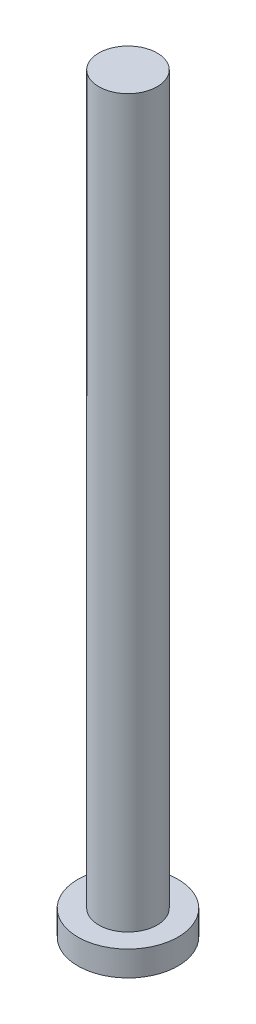
ISO-10303-21;
HEADER;
FILE_DESCRIPTION(('STEP AP214'),'2;1');
FILE_NAME('part.step','',(''),(''),'','','');
FILE_SCHEMA(('AUTOMOTIVE_DESIGN { 1 0 10303 214 1 1 1 1 }'));
ENDSEC;
DATA;
#1=APPLICATION_CONTEXT('core data for automotive mechanical design processes');
#2=APPLICATION_PROTOCOL_DEFINITION('international standard','automotive_design',2000,#1);
#3=PRODUCT_CONTEXT('',#1,'mechanical');
#4=PRODUCT('Part','Part','',(#3));
#5=PRODUCT_RELATED_PRODUCT_CATEGORY('part','',(#4));
#6=PRODUCT_DEFINITION_FORMATION('','',#4);
#7=PRODUCT_DEFINITION_CONTEXT('part definition',#1,'design');
#8=PRODUCT_DEFINITION('design','',#6,#7);
#9=PRODUCT_DEFINITION_SHAPE('','',#8);
#10=(LENGTH_UNIT() NAMED_UNIT(*) SI_UNIT(.MILLI.,.METRE.));
#11=(NAMED_UNIT(*) PLANE_ANGLE_UNIT() SI_UNIT($,.RADIAN.));
#12=(NAMED_UNIT(*) SI_UNIT($,.STERADIAN.) SOLID_ANGLE_UNIT());
#13=UNCERTAINTY_MEASURE_WITH_UNIT(LENGTH_MEASURE(1.E-05),#10,'distance_accuracy_value','');
#14=(GEOMETRIC_REPRESENTATION_CONTEXT(3) GLOBAL_UNCERTAINTY_ASSIGNED_CONTEXT((#13)) GLOBAL_UNIT_ASSIGNED_CONTEXT((#10,
#11,#12)) REPRESENTATION_CONTEXT('',''));
#15=CARTESIAN_POINT('',(0.,0.,0.));
#16=DIRECTION('',(0.,0.,1.));
#17=DIRECTION('',(1.,0.,0.));
#18=AXIS2_PLACEMENT_3D('',#15,#16,#17);
#19=CARTESIAN_POINT('',(9.50000000000001,3.,0.));
#20=DIRECTION('',(0.,-1.,0.));
#21=DIRECTION('',(1.,0.,0.));
#22=AXIS2_PLACEMENT_3D('',#19,#20,#21);
#23=PLANE('',#22);
#24=CARTESIAN_POINT('',(6.,3.,0.));
#25=DIRECTION('',(0.,1.,0.));
#26=DIRECTION('',(-1.,0.,0.));
#27=AXIS2_PLACEMENT_3D('',#24,#25,#26);
#28=CIRCLE('',#27,3.50000000000001);
#29=CARTESIAN_POINT('',(2.49999999999999,3.,0.));
#30=VERTEX_POINT('',#29);
#31=EDGE_CURVE('E10',#30,#30,#28,.T.);
#32=ORIENTED_EDGE('',*,*,#31,.F.);
#33=EDGE_LOOP('',(#32));
#34=FACE_BOUND('',#33,.T.);
#35=CARTESIAN_POINT('',(6.,3.,0.));
#36=DIRECTION('',(0.,1.,0.));
#37=DIRECTION('',(-1.,0.,0.));
#38=AXIS2_PLACEMENT_3D('',#35,#36,#37);
#39=CIRCLE('',#38,6.);
#40=CARTESIAN_POINT('',(0.,3.,0.));
#41=VERTEX_POINT('',#40);
#42=EDGE_CURVE('E45',#41,#41,#39,.T.);
#43=ORIENTED_EDGE('',*,*,#42,.T.);
#44=EDGE_LOOP('',(#43));
#45=FACE_BOUND('',#44,.T.);
#46=ADVANCED_FACE('F31',(#34,#45),#23,.F.);
#47=CARTESIAN_POINT('',(5.99999999999997,90.,0.));
#48=DIRECTION('',(0.,1.,0.));
#49=DIRECTION('',(-1.,0.,0.));
#50=AXIS2_PLACEMENT_3D('',#47,#48,#49);
#51=CYLINDRICAL_SURFACE('',#50,3.5);
#52=CARTESIAN_POINT('',(5.99999999999997,90.,0.));
#53=DIRECTION('',(0.,1.,0.));
#54=DIRECTION('',(-1.,0.,0.));
#55=AXIS2_PLACEMENT_3D('',#52,#53,#54);
#56=CIRCLE('',#55,3.5);
#57=CARTESIAN_POINT('',(2.49999999999997,90.,0.));
#58=VERTEX_POINT('',#57);
#59=EDGE_CURVE('E37',#58,#58,#56,.T.);
#60=ORIENTED_EDGE('',*,*,#59,.F.);
#61=EDGE_LOOP('',(#60));
#62=FACE_BOUND('',#61,.T.);
#63=ORIENTED_EDGE('',*,*,#31,.T.);
#64=EDGE_LOOP('',(#63));
#65=FACE_BOUND('',#64,.T.);
#66=ADVANCED_FACE('F65',(#62,#65),#51,.T.);
#67=CARTESIAN_POINT('',(9.49999999999997,90.,0.));
#68=DIRECTION('',(0.,-1.,0.));
#69=DIRECTION('',(1.,0.,0.));
#70=AXIS2_PLACEMENT_3D('',#67,#68,#69);
#71=PLANE('',#70);
#72=ORIENTED_EDGE('',*,*,#59,.T.);
#73=EDGE_LOOP('',(#72));
#74=FACE_BOUND('',#73,.T.);
#75=ADVANCED_FACE('F60',(#74),#71,.F.);
#76=CARTESIAN_POINT('',(6.,0.,0.));
#77=DIRECTION('',(0.,1.,0.));
#78=DIRECTION('',(-1.,0.,0.));
#79=AXIS2_PLACEMENT_3D('',#76,#77,#78);
#80=PLANE('',#79);
#81=CARTESIAN_POINT('',(6.,0.,0.));
#82=DIRECTION('',(0.,1.,0.));
#83=DIRECTION('',(-1.,0.,0.));
#84=AXIS2_PLACEMENT_3D('',#81,#82,#83);
#85=CIRCLE('',#84,6.);
#86=CARTESIAN_POINT('',(0.,0.,0.));
#87=VERTEX_POINT('',#86);
#88=EDGE_CURVE('E41',#87,#87,#85,.T.);
#89=ORIENTED_EDGE('',*,*,#88,.F.);
#90=EDGE_LOOP('',(#89));
#91=FACE_BOUND('',#90,.T.);
#92=ADVANCED_FACE('F55',(#91),#80,.F.);
#93=CARTESIAN_POINT('',(5.99999999999997,90.,0.));
#94=DIRECTION('',(0.,1.,0.));
#95=DIRECTION('',(-1.,0.,0.));
#96=AXIS2_PLACEMENT_3D('',#93,#94,#95);
#97=CYLINDRICAL_SURFACE('',#96,6.);
#98=ORIENTED_EDGE('',*,*,#42,.F.);
#99=EDGE_LOOP('',(#98));
#100=FACE_BOUND('',#99,.T.);
#101=ORIENTED_EDGE('',*,*,#88,.T.);
#102=EDGE_LOOP('',(#101));
#103=FACE_BOUND('',#102,.T.);
#104=ADVANCED_FACE('F52',(#100,#103),#97,.T.);
#105=CLOSED_SHELL('',(#46,#66,#75,#92,#104));
#106=MANIFOLD_SOLID_BREP('B2',#105);
#107=ADVANCED_BREP_SHAPE_REPRESENTATION('',(#18,#106),#14);
#108=SHAPE_DEFINITION_REPRESENTATION(#9,#107);
ENDSEC;
END-ISO-10303-21;
